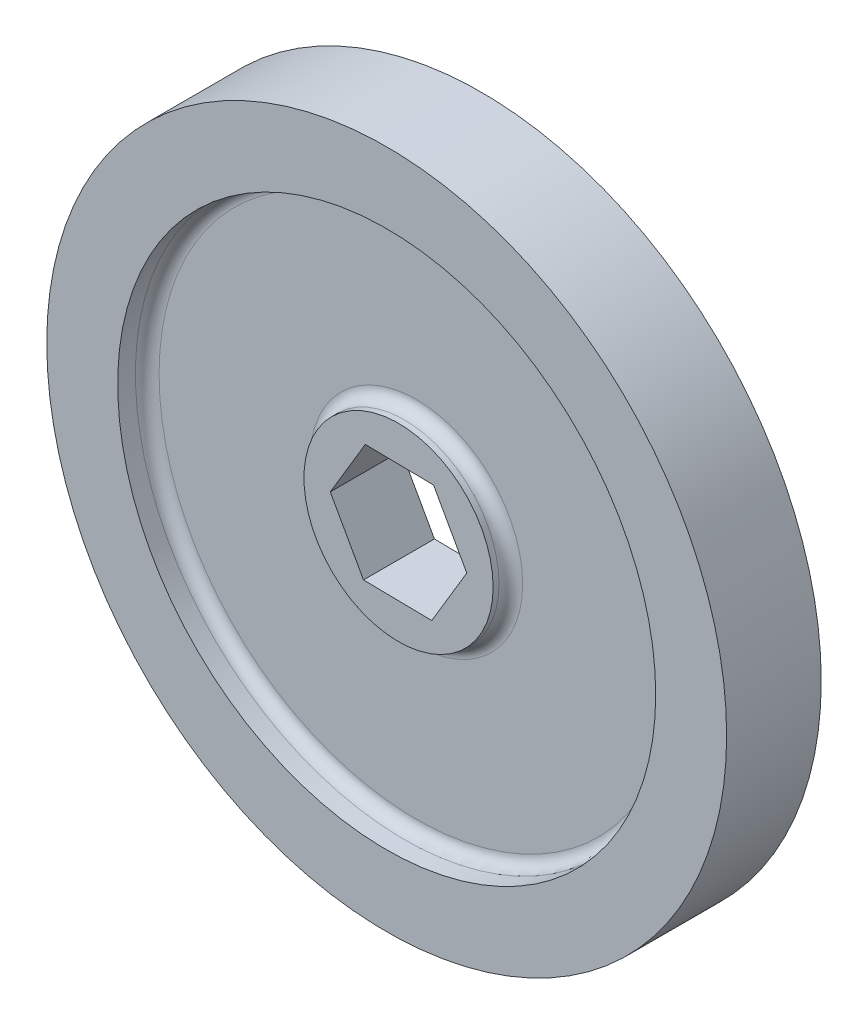
ISO-10303-21;
HEADER;
FILE_DESCRIPTION(('STEP AP214'),'2;1');
FILE_NAME('part.step','',(''),(''),'','','');
FILE_SCHEMA(('AUTOMOTIVE_DESIGN { 1 0 10303 214 1 1 1 1 }'));
ENDSEC;
DATA;
#1=APPLICATION_CONTEXT('core data for automotive mechanical design processes');
#2=APPLICATION_PROTOCOL_DEFINITION('international standard','automotive_design',2000,#1);
#3=PRODUCT_CONTEXT('',#1,'mechanical');
#4=PRODUCT('Part','Part','',(#3));
#5=PRODUCT_RELATED_PRODUCT_CATEGORY('part','',(#4));
#6=PRODUCT_DEFINITION_FORMATION('','',#4);
#7=PRODUCT_DEFINITION_CONTEXT('part definition',#1,'design');
#8=PRODUCT_DEFINITION('design','',#6,#7);
#9=PRODUCT_DEFINITION_SHAPE('','',#8);
#10=(LENGTH_UNIT() NAMED_UNIT(*) SI_UNIT(.MILLI.,.METRE.));
#11=(NAMED_UNIT(*) PLANE_ANGLE_UNIT() SI_UNIT($,.RADIAN.));
#12=(NAMED_UNIT(*) SI_UNIT($,.STERADIAN.) SOLID_ANGLE_UNIT());
#13=UNCERTAINTY_MEASURE_WITH_UNIT(LENGTH_MEASURE(1.E-05),#10,'distance_accuracy_value','');
#14=(GEOMETRIC_REPRESENTATION_CONTEXT(3) GLOBAL_UNCERTAINTY_ASSIGNED_CONTEXT((#13)) GLOBAL_UNIT_ASSIGNED_CONTEXT((#10,
#11,#12)) REPRESENTATION_CONTEXT('',''));
#15=CARTESIAN_POINT('',(0.,0.,0.));
#16=DIRECTION('',(0.,0.,1.));
#17=DIRECTION('',(1.,0.,0.));
#18=AXIS2_PLACEMENT_3D('',#15,#16,#17);
#19=CARTESIAN_POINT('',(-3.76226704796302,-6.29354272196074,10.16));
#20=DIRECTION('',(0.0151994247971552,0.999884482070722,0.));
#21=DIRECTION('',(-0.999884482070722,0.0151994247971552,0.));
#22=AXIS2_PLACEMENT_3D('',#19,#20,#21);
#23=PLANE('',#22);
#24=DIRECTION('',(0.,0.,-1.));
#25=VECTOR('',#24,1.);
#26=CARTESIAN_POINT('',(-3.76226704796302,-6.29354272196074,10.16));
#27=LINE('',#26,#25);
#28=CARTESIAN_POINT('',(-3.76226704796302,-6.29354272196074,8.89));
#29=VERTEX_POINT('',#28);
#30=CARTESIAN_POINT('',(-3.76226704796302,-6.29354272196074,1.27));
#31=VERTEX_POINT('',#30);
#32=EDGE_CURVE('E109',#29,#31,#27,.T.);
#33=ORIENTED_EDGE('',*,*,#32,.F.);
#34=DIRECTION('',(0.999884482070722,-0.0151994247971552,0.));
#35=VECTOR('',#34,1.);
#36=CARTESIAN_POINT('',(-3.76226704796302,-6.29354272196074,8.89));
#37=LINE('',#36,#35);
#38=CARTESIAN_POINT('',(3.56923435303915,-6.40499020033743,8.89));
#39=VERTEX_POINT('',#38);
#40=EDGE_CURVE('E54',#29,#39,#37,.T.);
#41=ORIENTED_EDGE('',*,*,#40,.T.);
#42=DIRECTION('',(0.,0.,-1.));
#43=VECTOR('',#42,1.);
#44=CARTESIAN_POINT('',(3.56923435303915,-6.40499020033743,10.16));
#45=LINE('',#44,#43);
#46=CARTESIAN_POINT('',(3.56923435303915,-6.40499020033743,1.27));
#47=VERTEX_POINT('',#46);
#48=EDGE_CURVE('E120',#39,#47,#45,.T.);
#49=ORIENTED_EDGE('',*,*,#48,.T.);
#50=DIRECTION('',(-0.999884482070722,0.0151994247971552,0.));
#51=VECTOR('',#50,1.);
#52=CARTESIAN_POINT('',(-3.76226704796302,-6.29354272196074,1.27));
#53=LINE('',#52,#51);
#54=EDGE_CURVE('E189',#47,#31,#53,.T.);
#55=ORIENTED_EDGE('',*,*,#54,.T.);
#56=EDGE_LOOP('',(#33,#41,#49,#55));
#57=FACE_BOUND('',#56,.T.);
#58=ADVANCED_FACE('F39',(#57),#23,.T.);
#59=CARTESIAN_POINT('',(3.56923435303915,-6.40499020033743,10.16));
#60=DIRECTION('',(-0.858325649924513,0.513105329032609,0.));
#61=DIRECTION('',(-0.513105329032609,-0.858325649924513,0.));
#62=AXIS2_PLACEMENT_3D('',#59,#60,#61);
#63=PLANE('',#62);
#64=ORIENTED_EDGE('',*,*,#48,.F.);
#65=DIRECTION('',(0.513105329032609,0.858325649924513,0.));
#66=VECTOR('',#65,1.);
#67=CARTESIAN_POINT('',(3.56923435303915,-6.40499020033743,8.89));
#68=LINE('',#67,#66);
#69=CARTESIAN_POINT('',(7.33150140100217,-0.1114474783767,8.89));
#70=VERTEX_POINT('',#69);
#71=EDGE_CURVE('E170',#39,#70,#68,.T.);
#72=ORIENTED_EDGE('',*,*,#71,.T.);
#73=DIRECTION('',(0.,0.,-1.));
#74=VECTOR('',#73,1.);
#75=CARTESIAN_POINT('',(7.33150140100217,-0.1114474783767,10.16));
#76=LINE('',#75,#74);
#77=CARTESIAN_POINT('',(7.33150140100217,-0.1114474783767,1.27));
#78=VERTEX_POINT('',#77);
#79=EDGE_CURVE('E118',#70,#78,#76,.T.);
#80=ORIENTED_EDGE('',*,*,#79,.T.);
#81=DIRECTION('',(-0.513105329032609,-0.858325649924513,0.));
#82=VECTOR('',#81,1.);
#83=CARTESIAN_POINT('',(3.56923435303915,-6.40499020033743,1.27));
#84=LINE('',#83,#82);
#85=EDGE_CURVE('E186',#78,#47,#84,.T.);
#86=ORIENTED_EDGE('',*,*,#85,.T.);
#87=EDGE_LOOP('',(#64,#72,#80,#86));
#88=FACE_BOUND('',#87,.T.);
#89=ADVANCED_FACE('F219',(#88),#63,.T.);
#90=CARTESIAN_POINT('',(7.33150140100217,-0.1114474783767,10.16));
#91=DIRECTION('',(-0.873525074721669,-0.486779153038114,0.));
#92=DIRECTION('',(0.486779153038114,-0.873525074721669,0.));
#93=AXIS2_PLACEMENT_3D('',#90,#91,#92);
#94=PLANE('',#93);
#95=ORIENTED_EDGE('',*,*,#79,.F.);
#96=DIRECTION('',(-0.486779153038114,0.873525074721669,0.));
#97=VECTOR('',#96,1.);
#98=CARTESIAN_POINT('',(7.33150140100217,-0.1114474783767,8.89));
#99=LINE('',#98,#97);
#100=CARTESIAN_POINT('',(3.76226704796302,6.29354272196073,8.89));
#101=VERTEX_POINT('',#100);
#102=EDGE_CURVE('E167',#70,#101,#99,.T.);
#103=ORIENTED_EDGE('',*,*,#102,.T.);
#104=DIRECTION('',(0.,0.,-1.));
#105=VECTOR('',#104,1.);
#106=CARTESIAN_POINT('',(3.76226704796302,6.29354272196073,10.16));
#107=LINE('',#106,#105);
#108=CARTESIAN_POINT('',(3.76226704796302,6.29354272196073,1.27));
#109=VERTEX_POINT('',#108);
#110=EDGE_CURVE('E111',#101,#109,#107,.T.);
#111=ORIENTED_EDGE('',*,*,#110,.T.);
#112=DIRECTION('',(0.486779153038114,-0.873525074721669,0.));
#113=VECTOR('',#112,1.);
#114=CARTESIAN_POINT('',(7.33150140100217,-0.1114474783767,1.27));
#115=LINE('',#114,#113);
#116=EDGE_CURVE('E183',#109,#78,#115,.T.);
#117=ORIENTED_EDGE('',*,*,#116,.T.);
#118=EDGE_LOOP('',(#95,#103,#111,#117));
#119=FACE_BOUND('',#118,.T.);
#120=ADVANCED_FACE('F225',(#119),#94,.T.);
#121=CARTESIAN_POINT('',(3.76226704796302,6.29354272196073,10.16));
#122=DIRECTION('',(-0.0151994247971554,-0.999884482070722,0.));
#123=DIRECTION('',(0.999884482070722,-0.0151994247971554,0.));
#124=AXIS2_PLACEMENT_3D('',#121,#122,#123);
#125=PLANE('',#124);
#126=ORIENTED_EDGE('',*,*,#110,.F.);
#127=DIRECTION('',(-0.999884482070722,0.0151994247971554,0.));
#128=VECTOR('',#127,1.);
#129=CARTESIAN_POINT('',(3.76226704796302,6.29354272196073,8.89));
#130=LINE('',#129,#128);
#131=CARTESIAN_POINT('',(-3.56923435303916,6.40499020033743,8.89));
#132=VERTEX_POINT('',#131);
#133=EDGE_CURVE('E103',#101,#132,#130,.T.);
#134=ORIENTED_EDGE('',*,*,#133,.T.);
#135=DIRECTION('',(0.,0.,-1.));
#136=VECTOR('',#135,1.);
#137=CARTESIAN_POINT('',(-3.56923435303916,6.40499020033743,10.16));
#138=LINE('',#137,#136);
#139=CARTESIAN_POINT('',(-3.56923435303916,6.40499020033743,1.27));
#140=VERTEX_POINT('',#139);
#141=EDGE_CURVE('E102',#132,#140,#138,.T.);
#142=ORIENTED_EDGE('',*,*,#141,.T.);
#143=DIRECTION('',(0.999884482070722,-0.0151994247971554,0.));
#144=VECTOR('',#143,1.);
#145=CARTESIAN_POINT('',(3.76226704796302,6.29354272196073,1.27));
#146=LINE('',#145,#144);
#147=EDGE_CURVE('E180',#140,#109,#146,.T.);
#148=ORIENTED_EDGE('',*,*,#147,.T.);
#149=EDGE_LOOP('',(#126,#134,#142,#148));
#150=FACE_BOUND('',#149,.T.);
#151=ADVANCED_FACE('F231',(#150),#125,.T.);
#152=CARTESIAN_POINT('',(-3.56923435303916,6.40499020033743,10.16));
#153=DIRECTION('',(0.858325649924514,-0.513105329032609,0.));
#154=DIRECTION('',(0.513105329032609,0.858325649924514,0.));
#155=AXIS2_PLACEMENT_3D('',#152,#153,#154);
#156=PLANE('',#155);
#157=ORIENTED_EDGE('',*,*,#141,.F.);
#158=DIRECTION('',(-0.513105329032609,-0.858325649924514,0.));
#159=VECTOR('',#158,1.);
#160=CARTESIAN_POINT('',(-3.56923435303916,6.40499020033743,8.89));
#161=LINE('',#160,#159);
#162=CARTESIAN_POINT('',(-7.33150140100217,0.111447478376703,8.89));
#163=VERTEX_POINT('',#162);
#164=EDGE_CURVE('E94',#132,#163,#161,.T.);
#165=ORIENTED_EDGE('',*,*,#164,.T.);
#166=DIRECTION('',(0.,0.,-1.));
#167=VECTOR('',#166,1.);
#168=CARTESIAN_POINT('',(-7.33150140100217,0.111447478376703,10.16));
#169=LINE('',#168,#167);
#170=CARTESIAN_POINT('',(-7.33150140100217,0.111447478376703,1.27));
#171=VERTEX_POINT('',#170);
#172=EDGE_CURVE('E62',#163,#171,#169,.T.);
#173=ORIENTED_EDGE('',*,*,#172,.T.);
#174=DIRECTION('',(0.513105329032609,0.858325649924514,0.));
#175=VECTOR('',#174,1.);
#176=CARTESIAN_POINT('',(-3.56923435303916,6.40499020033743,1.27));
#177=LINE('',#176,#175);
#178=EDGE_CURVE('E178',#171,#140,#177,.T.);
#179=ORIENTED_EDGE('',*,*,#178,.T.);
#180=EDGE_LOOP('',(#157,#165,#173,#179));
#181=FACE_BOUND('',#180,.T.);
#182=ADVANCED_FACE('F101',(#181),#156,.T.);
#183=CARTESIAN_POINT('',(-7.33150140100217,0.111447478376703,10.16));
#184=DIRECTION('',(0.873525074721669,0.486779153038113,0.));
#185=DIRECTION('',(-0.486779153038113,0.873525074721669,0.));
#186=AXIS2_PLACEMENT_3D('',#183,#184,#185);
#187=PLANE('',#186);
#188=ORIENTED_EDGE('',*,*,#172,.F.);
#189=DIRECTION('',(0.486779153038113,-0.873525074721669,0.));
#190=VECTOR('',#189,1.);
#191=CARTESIAN_POINT('',(-7.33150140100217,0.111447478376703,8.89));
#192=LINE('',#191,#190);
#193=EDGE_CURVE('E91',#163,#29,#192,.T.);
#194=ORIENTED_EDGE('',*,*,#193,.T.);
#195=ORIENTED_EDGE('',*,*,#32,.T.);
#196=DIRECTION('',(-0.486779153038113,0.873525074721669,0.));
#197=VECTOR('',#196,1.);
#198=CARTESIAN_POINT('',(-7.33150140100217,0.111447478376703,1.27));
#199=LINE('',#198,#197);
#200=EDGE_CURVE('E108',#31,#171,#199,.T.);
#201=ORIENTED_EDGE('',*,*,#200,.T.);
#202=EDGE_LOOP('',(#188,#194,#195,#201));
#203=FACE_BOUND('',#202,.T.);
#204=ADVANCED_FACE('F106',(#203),#187,.T.);
#205=CARTESIAN_POINT('',(0.,0.,6.985));
#206=DIRECTION('',(0.,0.,1.));
#207=DIRECTION('',(1.,0.,0.));
#208=AXIS2_PLACEMENT_3D('',#205,#206,#207);
#209=CYLINDRICAL_SURFACE('',#208,10.16);
#210=CARTESIAN_POINT('',(0.,0.,8.255));
#211=DIRECTION('',(0.,0.,1.));
#212=DIRECTION('',(1.,0.,0.));
#213=AXIS2_PLACEMENT_3D('',#210,#211,#212);
#214=CIRCLE('',#213,10.16);
#215=CARTESIAN_POINT('',(10.16,0.,8.255));
#216=VERTEX_POINT('',#215);
#217=EDGE_CURVE('E140',#216,#216,#214,.T.);
#218=ORIENTED_EDGE('',*,*,#217,.T.);
#219=EDGE_LOOP('',(#218));
#220=FACE_BOUND('',#219,.T.);
#221=CARTESIAN_POINT('',(0.,0.,8.89));
#222=DIRECTION('',(0.,0.,1.));
#223=DIRECTION('',(1.,0.,0.));
#224=AXIS2_PLACEMENT_3D('',#221,#222,#223);
#225=CIRCLE('',#224,10.16);
#226=CARTESIAN_POINT('',(10.16,0.,8.89));
#227=VERTEX_POINT('',#226);
#228=EDGE_CURVE('E98',#227,#227,#225,.T.);
#229=ORIENTED_EDGE('',*,*,#228,.F.);
#230=EDGE_LOOP('',(#229));
#231=FACE_BOUND('',#230,.T.);
#232=ADVANCED_FACE('F157',(#220,#231),#209,.T.);
#233=CARTESIAN_POINT('',(0.,0.,3.175));
#234=DIRECTION('',(0.,0.,-1.));
#235=DIRECTION('',(-1.,0.,0.));
#236=AXIS2_PLACEMENT_3D('',#233,#234,#235);
#237=CYLINDRICAL_SURFACE('',#236,10.16);
#238=CARTESIAN_POINT('',(0.,0.,1.905));
#239=DIRECTION('',(0.,0.,-1.));
#240=DIRECTION('',(-1.,0.,0.));
#241=AXIS2_PLACEMENT_3D('',#238,#239,#240);
#242=CIRCLE('',#241,10.16);
#243=CARTESIAN_POINT('',(-10.16,0.,1.905));
#244=VERTEX_POINT('',#243);
#245=EDGE_CURVE('E126',#244,#244,#242,.T.);
#246=ORIENTED_EDGE('',*,*,#245,.T.);
#247=EDGE_LOOP('',(#246));
#248=FACE_BOUND('',#247,.T.);
#249=CARTESIAN_POINT('',(0.,0.,1.27));
#250=DIRECTION('',(0.,0.,-1.));
#251=DIRECTION('',(-1.,0.,0.));
#252=AXIS2_PLACEMENT_3D('',#249,#250,#251);
#253=CIRCLE('',#252,10.16);
#254=CARTESIAN_POINT('',(-10.16,0.,1.27));
#255=VERTEX_POINT('',#254);
#256=EDGE_CURVE('E174',#255,#255,#253,.T.);
#257=ORIENTED_EDGE('',*,*,#256,.F.);
#258=EDGE_LOOP('',(#257));
#259=FACE_BOUND('',#258,.T.);
#260=ADVANCED_FACE('F160',(#248,#259),#237,.T.);
#261=CARTESIAN_POINT('',(0.,0.,10.16));
#262=DIRECTION('',(0.,0.,1.));
#263=DIRECTION('',(1.,0.,0.));
#264=AXIS2_PLACEMENT_3D('',#261,#262,#263);
#265=PLANE('',#264);
#266=CARTESIAN_POINT('',(0.,0.,10.16));
#267=DIRECTION('',(0.,0.,1.));
#268=DIRECTION('',(1.,0.,0.));
#269=AXIS2_PLACEMENT_3D('',#266,#267,#268);
#270=CIRCLE('',#269,28.8925);
#271=CARTESIAN_POINT('',(28.8925,0.,10.16));
#272=VERTEX_POINT('',#271);
#273=EDGE_CURVE('E113',#272,#272,#270,.T.);
#274=ORIENTED_EDGE('',*,*,#273,.F.);
#275=EDGE_LOOP('',(#274));
#276=FACE_BOUND('',#275,.T.);
#277=CARTESIAN_POINT('',(0.,0.,10.16));
#278=DIRECTION('',(0.,0.,1.));
#279=DIRECTION('',(1.,0.,0.));
#280=AXIS2_PLACEMENT_3D('',#277,#278,#279);
#281=CIRCLE('',#280,36.5125);
#282=CARTESIAN_POINT('',(36.5125,0.,10.16));
#283=VERTEX_POINT('',#282);
#284=EDGE_CURVE('E123',#283,#283,#281,.T.);
#285=ORIENTED_EDGE('',*,*,#284,.T.);
#286=EDGE_LOOP('',(#285));
#287=FACE_BOUND('',#286,.T.);
#288=ADVANCED_FACE('F199',(#276,#287),#265,.T.);
#289=CARTESIAN_POINT('',(0.,0.,0.));
#290=DIRECTION('',(0.,0.,1.));
#291=DIRECTION('',(1.,0.,0.));
#292=AXIS2_PLACEMENT_3D('',#289,#290,#291);
#293=PLANE('',#292);
#294=CARTESIAN_POINT('',(0.,0.,0.));
#295=DIRECTION('',(0.,0.,-1.));
#296=DIRECTION('',(-1.,0.,0.));
#297=AXIS2_PLACEMENT_3D('',#294,#295,#296);
#298=CIRCLE('',#297,28.8925);
#299=CARTESIAN_POINT('',(-28.8925,0.,0.));
#300=VERTEX_POINT('',#299);
#301=EDGE_CURVE('E192',#300,#300,#298,.T.);
#302=ORIENTED_EDGE('',*,*,#301,.F.);
#303=EDGE_LOOP('',(#302));
#304=FACE_BOUND('',#303,.T.);
#305=CARTESIAN_POINT('',(0.,0.,0.));
#306=DIRECTION('',(0.,0.,1.));
#307=DIRECTION('',(1.,0.,0.));
#308=AXIS2_PLACEMENT_3D('',#305,#306,#307);
#309=CIRCLE('',#308,36.5125);
#310=CARTESIAN_POINT('',(36.5125,0.,0.));
#311=VERTEX_POINT('',#310);
#312=EDGE_CURVE('E122',#311,#311,#309,.T.);
#313=ORIENTED_EDGE('',*,*,#312,.F.);
#314=EDGE_LOOP('',(#313));
#315=FACE_BOUND('',#314,.T.);
#316=ADVANCED_FACE('F202',(#304,#315),#293,.F.);
#317=CARTESIAN_POINT('',(0.,0.,10.16));
#318=DIRECTION('',(0.,0.,-1.));
#319=DIRECTION('',(-1.,0.,0.));
#320=AXIS2_PLACEMENT_3D('',#317,#318,#319);
#321=CYLINDRICAL_SURFACE('',#320,36.5125);
#322=ORIENTED_EDGE('',*,*,#284,.F.);
#323=EDGE_LOOP('',(#322));
#324=FACE_BOUND('',#323,.T.);
#325=ORIENTED_EDGE('',*,*,#312,.T.);
#326=EDGE_LOOP('',(#325));
#327=FACE_BOUND('',#326,.T.);
#328=ADVANCED_FACE('F206',(#324,#327),#321,.T.);
#329=CARTESIAN_POINT('',(0.,0.,6.985));
#330=DIRECTION('',(0.,0.,1.));
#331=DIRECTION('',(1.,0.,0.));
#332=AXIS2_PLACEMENT_3D('',#329,#330,#331);
#333=CYLINDRICAL_SURFACE('',#332,28.8925);
#334=CARTESIAN_POINT('',(0.,0.,8.255));
#335=DIRECTION('',(0.,0.,1.));
#336=DIRECTION('',(1.,0.,0.));
#337=AXIS2_PLACEMENT_3D('',#334,#335,#336);
#338=CIRCLE('',#337,28.8925);
#339=CARTESIAN_POINT('',(28.8925,0.,8.255));
#340=VERTEX_POINT('',#339);
#341=EDGE_CURVE('E11',#340,#340,#338,.F.);
#342=ORIENTED_EDGE('',*,*,#341,.T.);
#343=EDGE_LOOP('',(#342));
#344=FACE_BOUND('',#343,.T.);
#345=ORIENTED_EDGE('',*,*,#273,.T.);
#346=EDGE_LOOP('',(#345));
#347=FACE_BOUND('',#346,.T.);
#348=ADVANCED_FACE('F197',(#344,#347),#333,.F.);
#349=CARTESIAN_POINT('',(0.,0.,6.985));
#350=DIRECTION('',(0.,0.,1.));
#351=DIRECTION('',(1.,0.,0.));
#352=AXIS2_PLACEMENT_3D('',#349,#350,#351);
#353=PLANE('',#352);
#354=CARTESIAN_POINT('',(0.,0.,6.985));
#355=DIRECTION('',(0.,0.,1.));
#356=DIRECTION('',(1.,0.,0.));
#357=AXIS2_PLACEMENT_3D('',#354,#355,#356);
#358=CIRCLE('',#357,11.43);
#359=CARTESIAN_POINT('',(11.43,0.,6.985));
#360=VERTEX_POINT('',#359);
#361=EDGE_CURVE('E47',#360,#360,#358,.F.);
#362=ORIENTED_EDGE('',*,*,#361,.T.);
#363=EDGE_LOOP('',(#362));
#364=FACE_BOUND('',#363,.T.);
#365=CARTESIAN_POINT('',(0.,0.,6.985));
#366=DIRECTION('',(0.,0.,1.));
#367=DIRECTION('',(1.,0.,0.));
#368=AXIS2_PLACEMENT_3D('',#365,#366,#367);
#369=CIRCLE('',#368,27.6225);
#370=CARTESIAN_POINT('',(27.6225,0.,6.985));
#371=VERTEX_POINT('',#370);
#372=EDGE_CURVE('E143',#371,#371,#369,.T.);
#373=ORIENTED_EDGE('',*,*,#372,.T.);
#374=EDGE_LOOP('',(#373));
#375=FACE_BOUND('',#374,.T.);
#376=ADVANCED_FACE('F148',(#364,#375),#353,.T.);
#377=CARTESIAN_POINT('',(0.,0.,3.175));
#378=DIRECTION('',(0.,0.,-1.));
#379=DIRECTION('',(-1.,0.,0.));
#380=AXIS2_PLACEMENT_3D('',#377,#378,#379);
#381=CYLINDRICAL_SURFACE('',#380,28.8925);
#382=CARTESIAN_POINT('',(0.,0.,1.905));
#383=DIRECTION('',(0.,0.,-1.));
#384=DIRECTION('',(-1.,0.,0.));
#385=AXIS2_PLACEMENT_3D('',#382,#383,#384);
#386=CIRCLE('',#385,28.8925);
#387=CARTESIAN_POINT('',(-28.8925,0.,1.905));
#388=VERTEX_POINT('',#387);
#389=EDGE_CURVE('E137',#388,#388,#386,.F.);
#390=ORIENTED_EDGE('',*,*,#389,.T.);
#391=EDGE_LOOP('',(#390));
#392=FACE_BOUND('',#391,.T.);
#393=ORIENTED_EDGE('',*,*,#301,.T.);
#394=EDGE_LOOP('',(#393));
#395=FACE_BOUND('',#394,.T.);
#396=ADVANCED_FACE('F244',(#392,#395),#381,.F.);
#397=CARTESIAN_POINT('',(0.,0.,3.175));
#398=DIRECTION('',(0.,0.,-1.));
#399=DIRECTION('',(-1.,0.,0.));
#400=AXIS2_PLACEMENT_3D('',#397,#398,#399);
#401=PLANE('',#400);
#402=CARTESIAN_POINT('',(0.,0.,3.175));
#403=DIRECTION('',(0.,0.,-1.));
#404=DIRECTION('',(-1.,0.,0.));
#405=AXIS2_PLACEMENT_3D('',#402,#403,#404);
#406=CIRCLE('',#405,11.43);
#407=CARTESIAN_POINT('',(-11.43,0.,3.175));
#408=VERTEX_POINT('',#407);
#409=EDGE_CURVE('E134',#408,#408,#406,.F.);
#410=ORIENTED_EDGE('',*,*,#409,.T.);
#411=EDGE_LOOP('',(#410));
#412=FACE_BOUND('',#411,.T.);
#413=CARTESIAN_POINT('',(0.,0.,3.175));
#414=DIRECTION('',(0.,0.,-1.));
#415=DIRECTION('',(-1.,0.,0.));
#416=AXIS2_PLACEMENT_3D('',#413,#414,#415);
#417=CIRCLE('',#416,27.6225);
#418=CARTESIAN_POINT('',(-27.6225,0.,3.175));
#419=VERTEX_POINT('',#418);
#420=EDGE_CURVE('E131',#419,#419,#417,.T.);
#421=ORIENTED_EDGE('',*,*,#420,.T.);
#422=EDGE_LOOP('',(#421));
#423=FACE_BOUND('',#422,.T.);
#424=ADVANCED_FACE('F248',(#412,#423),#401,.T.);
#425=CARTESIAN_POINT('',(0.,0.,1.27));
#426=DIRECTION('',(0.,0.,-1.));
#427=DIRECTION('',(-1.,0.,0.));
#428=AXIS2_PLACEMENT_3D('',#425,#426,#427);
#429=PLANE('',#428);
#430=ORIENTED_EDGE('',*,*,#85,.F.);
#431=ORIENTED_EDGE('',*,*,#116,.F.);
#432=ORIENTED_EDGE('',*,*,#147,.F.);
#433=ORIENTED_EDGE('',*,*,#178,.F.);
#434=ORIENTED_EDGE('',*,*,#200,.F.);
#435=ORIENTED_EDGE('',*,*,#54,.F.);
#436=EDGE_LOOP('',(#430,#431,#432,#433,#434,#435));
#437=FACE_BOUND('',#436,.T.);
#438=ORIENTED_EDGE('',*,*,#256,.T.);
#439=EDGE_LOOP('',(#438));
#440=FACE_BOUND('',#439,.T.);
#441=ADVANCED_FACE('F252',(#437,#440),#429,.T.);
#442=CARTESIAN_POINT('',(0.,0.,8.89));
#443=DIRECTION('',(0.,0.,1.));
#444=DIRECTION('',(1.,0.,0.));
#445=AXIS2_PLACEMENT_3D('',#442,#443,#444);
#446=PLANE('',#445);
#447=ORIENTED_EDGE('',*,*,#193,.F.);
#448=ORIENTED_EDGE('',*,*,#164,.F.);
#449=ORIENTED_EDGE('',*,*,#133,.F.);
#450=ORIENTED_EDGE('',*,*,#102,.F.);
#451=ORIENTED_EDGE('',*,*,#71,.F.);
#452=ORIENTED_EDGE('',*,*,#40,.F.);
#453=EDGE_LOOP('',(#447,#448,#449,#450,#451,#452));
#454=FACE_BOUND('',#453,.T.);
#455=ORIENTED_EDGE('',*,*,#228,.T.);
#456=EDGE_LOOP('',(#455));
#457=FACE_BOUND('',#456,.T.);
#458=ADVANCED_FACE('F92',(#454,#457),#446,.T.);
#459=CARTESIAN_POINT('',(0.,0.,1.905));
#460=DIRECTION('',(0.,0.,-1.));
#461=DIRECTION('',(-1.,0.,0.));
#462=AXIS2_PLACEMENT_3D('',#459,#460,#461);
#463=TOROIDAL_SURFACE('',#462,11.43,1.27);
#464=ORIENTED_EDGE('',*,*,#409,.F.);
#465=EDGE_LOOP('',(#464));
#466=FACE_BOUND('',#465,.T.);
#467=ORIENTED_EDGE('',*,*,#245,.F.);
#468=EDGE_LOOP('',(#467));
#469=FACE_BOUND('',#468,.T.);
#470=ADVANCED_FACE('F261',(#466,#469),#463,.F.);
#471=CARTESIAN_POINT('',(0.,0.,1.905));
#472=DIRECTION('',(0.,0.,-1.));
#473=DIRECTION('',(-1.,0.,0.));
#474=AXIS2_PLACEMENT_3D('',#471,#472,#473);
#475=TOROIDAL_SURFACE('',#474,27.6225,1.27);
#476=ORIENTED_EDGE('',*,*,#389,.F.);
#477=EDGE_LOOP('',(#476));
#478=FACE_BOUND('',#477,.T.);
#479=ORIENTED_EDGE('',*,*,#420,.F.);
#480=EDGE_LOOP('',(#479));
#481=FACE_BOUND('',#480,.T.);
#482=ADVANCED_FACE('F154',(#478,#481),#475,.F.);
#483=CARTESIAN_POINT('',(0.,0.,8.255));
#484=DIRECTION('',(0.,0.,1.));
#485=DIRECTION('',(1.,0.,0.));
#486=AXIS2_PLACEMENT_3D('',#483,#484,#485);
#487=TOROIDAL_SURFACE('',#486,11.43,1.27);
#488=ORIENTED_EDGE('',*,*,#361,.F.);
#489=EDGE_LOOP('',(#488));
#490=FACE_BOUND('',#489,.T.);
#491=ORIENTED_EDGE('',*,*,#217,.F.);
#492=EDGE_LOOP('',(#491));
#493=FACE_BOUND('',#492,.T.);
#494=ADVANCED_FACE('F151',(#490,#493),#487,.F.);
#495=CARTESIAN_POINT('',(0.,0.,8.255));
#496=DIRECTION('',(0.,0.,1.));
#497=DIRECTION('',(1.,0.,0.));
#498=AXIS2_PLACEMENT_3D('',#495,#496,#497);
#499=TOROIDAL_SURFACE('',#498,27.6225,1.27);
#500=ORIENTED_EDGE('',*,*,#341,.F.);
#501=EDGE_LOOP('',(#500));
#502=FACE_BOUND('',#501,.T.);
#503=ORIENTED_EDGE('',*,*,#372,.F.);
#504=EDGE_LOOP('',(#503));
#505=FACE_BOUND('',#504,.T.);
#506=ADVANCED_FACE('F41',(#502,#505),#499,.F.);
#507=CLOSED_SHELL('',(#58,#89,#120,#151,#182,#204,#232,#260,#288,#316,#328,#348,#376,#396,#424,
#441,#458,#470,#482,#494,#506));
#508=MANIFOLD_SOLID_BREP('B2',#507);
#509=ADVANCED_BREP_SHAPE_REPRESENTATION('',(#18,#508),#14);
#510=SHAPE_DEFINITION_REPRESENTATION(#9,#509);
ENDSEC;
END-ISO-10303-21;
